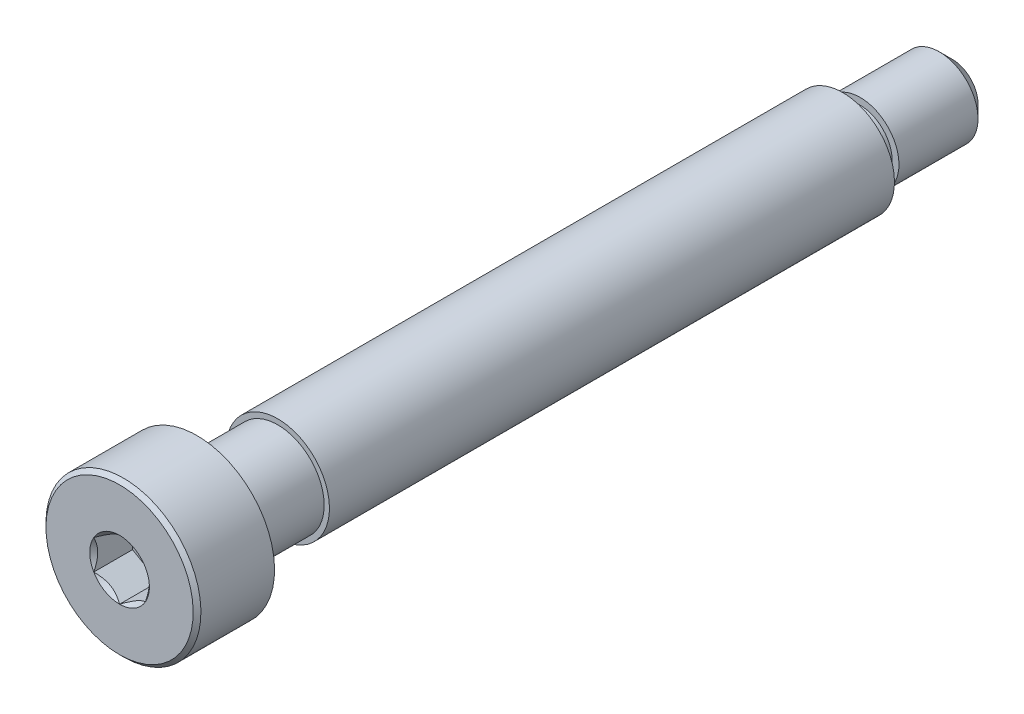
ISO-10303-21;
HEADER;
FILE_DESCRIPTION(('STEP AP214'),'2;1');
FILE_NAME('part.step','',(''),(''),'','','');
FILE_SCHEMA(('AUTOMOTIVE_DESIGN { 1 0 10303 214 1 1 1 1 }'));
ENDSEC;
DATA;
#1=APPLICATION_CONTEXT('core data for automotive mechanical design processes');
#2=APPLICATION_PROTOCOL_DEFINITION('international standard','automotive_design',2000,#1);
#3=PRODUCT_CONTEXT('',#1,'mechanical');
#4=PRODUCT('Part','Part','',(#3));
#5=PRODUCT_RELATED_PRODUCT_CATEGORY('part','',(#4));
#6=PRODUCT_DEFINITION_FORMATION('','',#4);
#7=PRODUCT_DEFINITION_CONTEXT('part definition',#1,'design');
#8=PRODUCT_DEFINITION('design','',#6,#7);
#9=PRODUCT_DEFINITION_SHAPE('','',#8);
#10=(LENGTH_UNIT() NAMED_UNIT(*) SI_UNIT(.MILLI.,.METRE.));
#11=(NAMED_UNIT(*) PLANE_ANGLE_UNIT() SI_UNIT($,.RADIAN.));
#12=(NAMED_UNIT(*) SI_UNIT($,.STERADIAN.) SOLID_ANGLE_UNIT());
#13=UNCERTAINTY_MEASURE_WITH_UNIT(LENGTH_MEASURE(1.E-05),#10,'distance_accuracy_value','');
#14=(GEOMETRIC_REPRESENTATION_CONTEXT(3) GLOBAL_UNCERTAINTY_ASSIGNED_CONTEXT((#13)) GLOBAL_UNIT_ASSIGNED_CONTEXT((#10,
#11,#12)) REPRESENTATION_CONTEXT('',''));
#15=CARTESIAN_POINT('',(0.,0.,0.));
#16=DIRECTION('',(0.,0.,1.));
#17=DIRECTION('',(1.,0.,0.));
#18=AXIS2_PLACEMENT_3D('',#15,#16,#17);
#19=CARTESIAN_POINT('',(0.,0.,16.121));
#20=DIRECTION('',(0.,0.,1.));
#21=DIRECTION('',(0.,-1.,0.));
#22=AXIS2_PLACEMENT_3D('',#19,#20,#21);
#23=CYLINDRICAL_SURFACE('',#22,3.);
#24=CARTESIAN_POINT('',(0.,0.,13.121));
#25=DIRECTION('',(0.,0.,1.));
#26=DIRECTION('',(0.,-1.,0.));
#27=AXIS2_PLACEMENT_3D('',#24,#25,#26);
#28=CIRCLE('',#27,3.);
#29=CARTESIAN_POINT('',(0.,-3.,13.121));
#30=VERTEX_POINT('',#29);
#31=EDGE_CURVE('E195',#30,#30,#28,.T.);
#32=ORIENTED_EDGE('',*,*,#31,.T.);
#33=EDGE_LOOP('',(#32));
#34=FACE_BOUND('',#33,.T.);
#35=CARTESIAN_POINT('',(0.,0.,15.971));
#36=DIRECTION('',(0.,0.,1.));
#37=DIRECTION('',(0.,-1.,0.));
#38=AXIS2_PLACEMENT_3D('',#35,#36,#37);
#39=CIRCLE('',#38,3.);
#40=CARTESIAN_POINT('',(0.,-3.,15.971));
#41=VERTEX_POINT('',#40);
#42=EDGE_CURVE('E455',#41,#41,#39,.T.);
#43=ORIENTED_EDGE('',*,*,#42,.F.);
#44=EDGE_LOOP('',(#43));
#45=FACE_BOUND('',#44,.T.);
#46=ADVANCED_FACE('F49',(#34,#45),#23,.T.);
#47=CARTESIAN_POINT('',(0.,2.,-11.879));
#48=DIRECTION('',(0.,0.,1.));
#49=DIRECTION('',(0.,-1.,0.));
#50=AXIS2_PLACEMENT_3D('',#47,#48,#49);
#51=PLANE('',#50);
#52=CARTESIAN_POINT('',(0.,0.,-11.879));
#53=DIRECTION('',(0.,0.,1.));
#54=DIRECTION('',(0.,-1.,0.));
#55=AXIS2_PLACEMENT_3D('',#52,#53,#54);
#56=CIRCLE('',#55,1.36904775);
#57=CARTESIAN_POINT('',(0.,-1.36904775,-11.879));
#58=VERTEX_POINT('',#57);
#59=EDGE_CURVE('E159',#58,#58,#56,.T.);
#60=ORIENTED_EDGE('',*,*,#59,.T.);
#61=EDGE_LOOP('',(#60));
#62=FACE_BOUND('',#61,.T.);
#63=CARTESIAN_POINT('',(0.,0.,-11.879));
#64=DIRECTION('',(0.,0.,1.));
#65=DIRECTION('',(0.,-1.,0.));
#66=AXIS2_PLACEMENT_3D('',#63,#64,#65);
#67=CIRCLE('',#66,1.5);
#68=CARTESIAN_POINT('',(0.,-1.5,-11.879));
#69=VERTEX_POINT('',#68);
#70=EDGE_CURVE('E186',#69,#69,#67,.T.);
#71=ORIENTED_EDGE('',*,*,#70,.F.);
#72=EDGE_LOOP('',(#71));
#73=FACE_BOUND('',#72,.T.);
#74=ADVANCED_FACE('F285',(#62,#73),#51,.F.);
#75=CARTESIAN_POINT('',(0.,1.5,-16.121));
#76=DIRECTION('',(0.,0.,1.));
#77=DIRECTION('',(0.,-1.,0.));
#78=AXIS2_PLACEMENT_3D('',#75,#76,#77);
#79=PLANE('',#78);
#80=CARTESIAN_POINT('',(0.,0.,-16.121));
#81=DIRECTION('',(0.,0.,1.));
#82=DIRECTION('',(0.,-1.,0.));
#83=AXIS2_PLACEMENT_3D('',#80,#81,#82);
#84=CIRCLE('',#83,0.99385198349999);
#85=CARTESIAN_POINT('',(0.,-0.99385198349999,-16.121));
#86=VERTEX_POINT('',#85);
#87=EDGE_CURVE('E12',#86,#86,#84,.F.);
#88=ORIENTED_EDGE('',*,*,#87,.T.);
#89=EDGE_LOOP('',(#88));
#90=FACE_BOUND('',#89,.T.);
#91=ADVANCED_FACE('F293',(#90),#79,.F.);
#92=CARTESIAN_POINT('',(0.,0.,16.121));
#93=DIRECTION('',(0.,0.,1.));
#94=DIRECTION('',(0.,-1.,0.));
#95=AXIS2_PLACEMENT_3D('',#92,#93,#94);
#96=CYLINDRICAL_SURFACE('',#95,1.5);
#97=CARTESIAN_POINT('',(0.,0.,-15.6148519835));
#98=DIRECTION('',(0.,0.,1.));
#99=DIRECTION('',(0.,-1.,0.));
#100=AXIS2_PLACEMENT_3D('',#97,#98,#99);
#101=CIRCLE('',#100,1.5);
#102=CARTESIAN_POINT('',(0.,-1.5,-15.6148519835));
#103=VERTEX_POINT('',#102);
#104=EDGE_CURVE('E58',#103,#103,#101,.T.);
#105=ORIENTED_EDGE('',*,*,#104,.T.);
#106=EDGE_LOOP('',(#105));
#107=FACE_BOUND('',#106,.T.);
#108=CARTESIAN_POINT('',(0.,0.,-12.553864022));
#109=DIRECTION('',(0.,0.,1.));
#110=DIRECTION('',(0.,-1.,0.));
#111=AXIS2_PLACEMENT_3D('',#108,#109,#110);
#112=CIRCLE('',#111,1.5);
#113=CARTESIAN_POINT('',(0.,-1.5,-12.553864022));
#114=VERTEX_POINT('',#113);
#115=EDGE_CURVE('E174',#114,#114,#112,.T.);
#116=ORIENTED_EDGE('',*,*,#115,.F.);
#117=EDGE_LOOP('',(#116));
#118=FACE_BOUND('',#117,.T.);
#119=ADVANCED_FACE('F489',(#107,#118),#96,.T.);
#120=CARTESIAN_POINT('',(0.,1.2380955,-12.553864022));
#121=DIRECTION('',(0.,0.,-1.));
#122=DIRECTION('',(0.,1.,0.));
#123=AXIS2_PLACEMENT_3D('',#120,#121,#122);
#124=PLANE('',#123);
#125=CARTESIAN_POINT('',(0.,0.,-12.553864022));
#126=DIRECTION('',(0.,0.,1.));
#127=DIRECTION('',(0.,-1.,0.));
#128=AXIS2_PLACEMENT_3D('',#125,#126,#127);
#129=CIRCLE('',#128,1.2380955);
#130=CARTESIAN_POINT('',(0.,-1.2380955,-12.553864022));
#131=VERTEX_POINT('',#130);
#132=EDGE_CURVE('E178',#131,#131,#129,.T.);
#133=ORIENTED_EDGE('',*,*,#132,.F.);
#134=EDGE_LOOP('',(#133));
#135=FACE_BOUND('',#134,.T.);
#136=ORIENTED_EDGE('',*,*,#115,.T.);
#137=EDGE_LOOP('',(#136));
#138=FACE_BOUND('',#137,.T.);
#139=ADVANCED_FACE('F332',(#135,#138),#124,.F.);
#140=CARTESIAN_POINT('',(0.,0.,16.121));
#141=DIRECTION('',(0.,0.,1.));
#142=DIRECTION('',(0.,-1.,0.));
#143=AXIS2_PLACEMENT_3D('',#140,#141,#142);
#144=CYLINDRICAL_SURFACE('',#143,1.2380955);
#145=CARTESIAN_POINT('',(0.,0.,-12.00995225));
#146=DIRECTION('',(0.,0.,1.));
#147=DIRECTION('',(0.,-1.,0.));
#148=AXIS2_PLACEMENT_3D('',#145,#146,#147);
#149=CIRCLE('',#148,1.2380955);
#150=CARTESIAN_POINT('',(0.,-1.2380955,-12.00995225));
#151=VERTEX_POINT('',#150);
#152=EDGE_CURVE('E182',#151,#151,#149,.T.);
#153=ORIENTED_EDGE('',*,*,#152,.F.);
#154=EDGE_LOOP('',(#153));
#155=FACE_BOUND('',#154,.T.);
#156=ORIENTED_EDGE('',*,*,#132,.T.);
#157=EDGE_LOOP('',(#156));
#158=FACE_BOUND('',#157,.T.);
#159=ADVANCED_FACE('F319',(#155,#158),#144,.T.);
#160=CARTESIAN_POINT('',(0.,0.,-12.00995225));
#161=DIRECTION('',(0.,0.,1.));
#162=DIRECTION('',(0.,-1.,0.));
#163=AXIS2_PLACEMENT_3D('',#160,#161,#162);
#164=TOROIDAL_SURFACE('',#163,1.36904775,0.13095225);
#165=ORIENTED_EDGE('',*,*,#59,.F.);
#166=EDGE_LOOP('',(#165));
#167=FACE_BOUND('',#166,.T.);
#168=ORIENTED_EDGE('',*,*,#152,.T.);
#169=EDGE_LOOP('',(#168));
#170=FACE_BOUND('',#169,.T.);
#171=ADVANCED_FACE('F314',(#167,#170),#164,.F.);
#172=CARTESIAN_POINT('',(0.,0.,-11.879));
#173=DIRECTION('',(0.,0.,-1.));
#174=DIRECTION('',(0.,1.,0.));
#175=AXIS2_PLACEMENT_3D('',#172,#173,#174);
#176=CONICAL_SURFACE('',#175,1.5,1.55722001811034);
#177=CARTESIAN_POINT('',(0.,0.,-11.8784827585288));
#178=DIRECTION('',(0.,0.,1.));
#179=DIRECTION('',(0.,-1.,0.));
#180=AXIS2_PLACEMENT_3D('',#177,#178,#179);
#181=CIRCLE('',#180,1.46190351116887);
#182=CARTESIAN_POINT('',(0.,-1.46190351116887,-11.8784827585288));
#183=VERTEX_POINT('',#182);
#184=EDGE_CURVE('E199',#183,#183,#181,.T.);
#185=ORIENTED_EDGE('',*,*,#184,.F.);
#186=EDGE_LOOP('',(#185));
#187=FACE_BOUND('',#186,.T.);
#188=ORIENTED_EDGE('',*,*,#70,.T.);
#189=EDGE_LOOP('',(#188));
#190=FACE_BOUND('',#189,.T.);
#191=ADVANCED_FACE('F311',(#187,#190),#176,.T.);
#192=CARTESIAN_POINT('',(0.,0.,9.99651724147122));
#193=DIRECTION('',(0.,0.,-1.));
#194=DIRECTION('',(0.,1.,0.));
#195=AXIS2_PLACEMENT_3D('',#192,#193,#194);
#196=CONICAL_SURFACE('',#195,1.75890351116887,1.55722001811025);
#197=CARTESIAN_POINT('',(0.,0.,9.996));
#198=DIRECTION('',(0.,0.,1.));
#199=DIRECTION('',(0.,-1.,0.));
#200=AXIS2_PLACEMENT_3D('',#197,#198,#199);
#201=CIRCLE('',#200,1.797);
#202=CARTESIAN_POINT('',(0.,-1.797,9.996));
#203=VERTEX_POINT('',#202);
#204=EDGE_CURVE('E194',#203,#203,#201,.T.);
#205=ORIENTED_EDGE('',*,*,#204,.F.);
#206=EDGE_LOOP('',(#205));
#207=FACE_BOUND('',#206,.T.);
#208=CARTESIAN_POINT('',(0.,0.,9.99651724147122));
#209=DIRECTION('',(0.,0.,1.));
#210=DIRECTION('',(0.,-1.,0.));
#211=AXIS2_PLACEMENT_3D('',#208,#209,#210);
#212=CIRCLE('',#211,1.75890351116887);
#213=CARTESIAN_POINT('',(0.,-1.75890351116887,9.99651724147122));
#214=VERTEX_POINT('',#213);
#215=EDGE_CURVE('E200',#214,#214,#212,.T.);
#216=ORIENTED_EDGE('',*,*,#215,.T.);
#217=EDGE_LOOP('',(#216));
#218=FACE_BOUND('',#217,.T.);
#219=ADVANCED_FACE('F307',(#207,#218),#196,.F.);
#220=CARTESIAN_POINT('',(0.,0.,9.99651724147122));
#221=DIRECTION('',(0.,0.,1.));
#222=DIRECTION('',(0.,-1.,0.));
#223=AXIS2_PLACEMENT_3D('',#220,#221,#222);
#224=CONICAL_SURFACE('',#223,1.75890351116887,0.0135763086846256);
#225=ORIENTED_EDGE('',*,*,#184,.T.);
#226=EDGE_LOOP('',(#225));
#227=FACE_BOUND('',#226,.T.);
#228=ORIENTED_EDGE('',*,*,#215,.F.);
#229=EDGE_LOOP('',(#228));
#230=FACE_BOUND('',#229,.T.);
#231=ADVANCED_FACE('F304',(#227,#230),#224,.T.);
#232=CARTESIAN_POINT('',(0.,3.,13.121));
#233=DIRECTION('',(0.,0.,1.));
#234=DIRECTION('',(0.,-1.,0.));
#235=AXIS2_PLACEMENT_3D('',#232,#233,#234);
#236=PLANE('',#235);
#237=ORIENTED_EDGE('',*,*,#31,.F.);
#238=EDGE_LOOP('',(#237));
#239=FACE_BOUND('',#238,.T.);
#240=CARTESIAN_POINT('',(0.,0.,13.121));
#241=DIRECTION('',(0.,0.,1.));
#242=DIRECTION('',(0.,-1.,0.));
#243=AXIS2_PLACEMENT_3D('',#240,#241,#242);
#244=CIRCLE('',#243,1.797);
#245=CARTESIAN_POINT('',(0.,-1.797,13.121));
#246=VERTEX_POINT('',#245);
#247=EDGE_CURVE('E190',#246,#246,#244,.T.);
#248=ORIENTED_EDGE('',*,*,#247,.T.);
#249=EDGE_LOOP('',(#248));
#250=FACE_BOUND('',#249,.T.);
#251=ADVANCED_FACE('F298',(#239,#250),#236,.F.);
#252=CARTESIAN_POINT('',(0.,0.,16.121));
#253=DIRECTION('',(0.,0.,1.));
#254=DIRECTION('',(0.,-1.,0.));
#255=AXIS2_PLACEMENT_3D('',#252,#253,#254);
#256=CYLINDRICAL_SURFACE('',#255,1.797);
#257=ORIENTED_EDGE('',*,*,#247,.F.);
#258=EDGE_LOOP('',(#257));
#259=FACE_BOUND('',#258,.T.);
#260=ORIENTED_EDGE('',*,*,#204,.T.);
#261=EDGE_LOOP('',(#260));
#262=FACE_BOUND('',#261,.T.);
#263=ADVANCED_FACE('F338',(#259,#262),#256,.T.);
#264=CARTESIAN_POINT('',(0.,0.,-15.6148519835));
#265=DIRECTION('',(0.,0.,1.));
#266=DIRECTION('',(0.,-1.,0.));
#267=AXIS2_PLACEMENT_3D('',#264,#265,#266);
#268=CONICAL_SURFACE('',#267,1.5,0.785398163397455);
#269=ORIENTED_EDGE('',*,*,#87,.F.);
#270=EDGE_LOOP('',(#269));
#271=FACE_BOUND('',#270,.T.);
#272=ORIENTED_EDGE('',*,*,#104,.F.);
#273=EDGE_LOOP('',(#272));
#274=FACE_BOUND('',#273,.T.);
#275=ADVANCED_FACE('F51',(#271,#274),#268,.T.);
#276=CARTESIAN_POINT('',(0.,0.,16.121));
#277=DIRECTION('',(0.,0.,-1.));
#278=DIRECTION('',(0.,1.,0.));
#279=AXIS2_PLACEMENT_3D('',#276,#277,#278);
#280=CONICAL_SURFACE('',#279,2.85,0.785398163397457);
#281=ORIENTED_EDGE('',*,*,#42,.T.);
#282=EDGE_LOOP('',(#281));
#283=FACE_BOUND('',#282,.T.);
#284=CARTESIAN_POINT('',(0.,0.,16.121));
#285=DIRECTION('',(0.,0.,1.));
#286=DIRECTION('',(0.,-1.,0.));
#287=AXIS2_PLACEMENT_3D('',#284,#285,#286);
#288=CIRCLE('',#287,2.85);
#289=CARTESIAN_POINT('',(0.,-2.85,16.121));
#290=VERTEX_POINT('',#289);
#291=EDGE_CURVE('E458',#290,#290,#288,.T.);
#292=ORIENTED_EDGE('',*,*,#291,.F.);
#293=EDGE_LOOP('',(#292));
#294=FACE_BOUND('',#293,.T.);
#295=ADVANCED_FACE('F230',(#283,#294),#280,.T.);
#296=CARTESIAN_POINT('',(0.,0.,14.621));
#297=DIRECTION('',(0.,0.,1.));
#298=DIRECTION('',(1.,0.,0.));
#299=AXIS2_PLACEMENT_3D('',#296,#297,#298);
#300=PLANE('',#299);
#301=DIRECTION('',(-0.866025403784439,0.499999999999999,0.));
#302=VECTOR('',#301,1.);
#303=CARTESIAN_POINT('',(1.,0.577350269189626,14.621));
#304=LINE('',#303,#302);
#305=CARTESIAN_POINT('',(1.,0.577350269189626,14.621));
#306=VERTEX_POINT('',#305);
#307=CARTESIAN_POINT('',(0.,1.15470053837925,14.621));
#308=VERTEX_POINT('',#307);
#309=EDGE_CURVE('E109',#306,#308,#304,.T.);
#310=ORIENTED_EDGE('',*,*,#309,.T.);
#311=DIRECTION('',(-0.866025403784438,-0.5,0.));
#312=VECTOR('',#311,1.);
#313=CARTESIAN_POINT('',(0.,1.15470053837925,14.621));
#314=LINE('',#313,#312);
#315=CARTESIAN_POINT('',(-1.,0.577350269189625,14.621));
#316=VERTEX_POINT('',#315);
#317=EDGE_CURVE('E120',#308,#316,#314,.T.);
#318=ORIENTED_EDGE('',*,*,#317,.T.);
#319=DIRECTION('',(0.,-1.,0.));
#320=VECTOR('',#319,1.);
#321=CARTESIAN_POINT('',(-1.,0.577350269189625,14.621));
#322=LINE('',#321,#320);
#323=CARTESIAN_POINT('',(-1.,-0.577350269189626,14.621));
#324=VERTEX_POINT('',#323);
#325=EDGE_CURVE('E127',#316,#324,#322,.T.);
#326=ORIENTED_EDGE('',*,*,#325,.T.);
#327=DIRECTION('',(0.866025403784439,-0.499999999999999,0.));
#328=VECTOR('',#327,1.);
#329=CARTESIAN_POINT('',(-1.,-0.577350269189626,14.621));
#330=LINE('',#329,#328);
#331=CARTESIAN_POINT('',(0.,-1.15470053837925,14.621));
#332=VERTEX_POINT('',#331);
#333=EDGE_CURVE('E147',#324,#332,#330,.T.);
#334=ORIENTED_EDGE('',*,*,#333,.T.);
#335=DIRECTION('',(0.866025403784438,0.5,0.));
#336=VECTOR('',#335,1.);
#337=CARTESIAN_POINT('',(0.,-1.15470053837925,14.621));
#338=LINE('',#337,#336);
#339=CARTESIAN_POINT('',(1.,-0.577350269189625,14.621));
#340=VERTEX_POINT('',#339);
#341=EDGE_CURVE('E151',#332,#340,#338,.T.);
#342=ORIENTED_EDGE('',*,*,#341,.T.);
#343=DIRECTION('',(0.,1.,0.));
#344=VECTOR('',#343,1.);
#345=CARTESIAN_POINT('',(1.,-0.577350269189625,14.621));
#346=LINE('',#345,#344);
#347=EDGE_CURVE('E117',#340,#306,#346,.T.);
#348=ORIENTED_EDGE('',*,*,#347,.T.);
#349=EDGE_LOOP('',(#310,#318,#326,#334,#342,#348));
#350=FACE_BOUND('',#349,.T.);
#351=ADVANCED_FACE('F129',(#350),#300,.T.);
#352=CARTESIAN_POINT('',(-1.,0.577350269189625,14.621));
#353=DIRECTION('',(-1.,0.,0.));
#354=DIRECTION('',(0.,-1.,0.));
#355=AXIS2_PLACEMENT_3D('',#352,#353,#354);
#356=PLANE('',#355);
#357=DIRECTION('',(0.,0.,1.));
#358=VECTOR('',#357,1.);
#359=CARTESIAN_POINT('',(-1.,0.577350269189625,14.621));
#360=LINE('',#359,#358);
#361=CARTESIAN_POINT('',(-0.999999999999999,0.577350269189626,16.121));
#362=VERTEX_POINT('',#361);
#363=EDGE_CURVE('E116',#316,#362,#360,.T.);
#364=ORIENTED_EDGE('',*,*,#363,.T.);
#365=CARTESIAN_POINT('',(-1.,-1.15147208646462,16.4913856775139));
#366=CARTESIAN_POINT('',(-1.,-1.12343447988552,16.4702199198737));
#367=CARTESIAN_POINT('',(-1.,-1.09524064850697,16.4492616921759));
#368=CARTESIAN_POINT('',(-1.,-1.03847715644376,16.4078460222356));
#369=CARTESIAN_POINT('',(-1.,-1.00990740382975,16.3873887061237));
#370=CARTESIAN_POINT('',(-1.,-0.923120894333478,16.3266047949545));
#371=CARTESIAN_POINT('',(-1.,-0.86425317375906,16.2871922289614));
#372=CARTESIAN_POINT('',(-1.,-0.740809858258045,16.2098206642002));
#373=CARTESIAN_POINT('',(-1.,-0.676100255137806,16.1720730391143));
#374=CARTESIAN_POINT('',(-1.,-0.543448939049123,16.1030245875513));
#375=CARTESIAN_POINT('',(-1.,-0.475519112027777,16.0717020278469));
#376=CARTESIAN_POINT('',(-1.,-0.373555850333527,16.0333817788838));
#377=CARTESIAN_POINT('',(-1.,-0.341031989670906,16.0223835916422));
#378=CARTESIAN_POINT('',(-1.,-0.275199079052292,16.0029983421474));
#379=CARTESIAN_POINT('',(-1.,-0.241889975173932,15.9946114597767));
#380=CARTESIAN_POINT('',(-1.,-0.175247517042992,15.981025220719));
#381=CARTESIAN_POINT('',(-1.,-0.141925568218174,15.975770790768));
#382=CARTESIAN_POINT('',(-1.,-0.0749144362322783,15.9685486865709));
#383=CARTESIAN_POINT('',(-1.,-0.0412251978501614,15.9665815136105));
#384=CARTESIAN_POINT('',(-1.,0.0249580992634208,15.9660831983932));
#385=CARTESIAN_POINT('',(-1.,0.0574512826460389,15.9674302678886));
#386=CARTESIAN_POINT('',(-1.,0.122148505701866,15.973216484499));
#387=CARTESIAN_POINT('',(-1.,0.154352610132926,15.9776549206615));
#388=CARTESIAN_POINT('',(-1.,0.218799898867639,15.9894568301452));
#389=CARTESIAN_POINT('',(-1.,0.251033743268953,15.9968705410385));
#390=CARTESIAN_POINT('',(-1.,0.314797132354918,16.0142289424987));
#391=CARTESIAN_POINT('',(-1.,0.346326735731004,16.0241734212888));
#392=CARTESIAN_POINT('',(-1.,0.445594187730204,16.0592234825543));
#393=CARTESIAN_POINT('',(-1.,0.511919139476035,16.0883208583567));
#394=CARTESIAN_POINT('',(-1.,0.641453244657531,16.1530153296865));
#395=CARTESIAN_POINT('',(-1.,0.704650133126343,16.1886357767152));
#396=CARTESIAN_POINT('',(-1.,0.825428490174986,16.2621239013469));
#397=CARTESIAN_POINT('',(-1.,0.883132947867685,16.2997919471355));
#398=CARTESIAN_POINT('',(-1.,0.968148853704567,16.3580228529432));
#399=CARTESIAN_POINT('',(-1.,0.996120570380287,16.3776384757629));
#400=CARTESIAN_POINT('',(-1.,1.05168177729902,16.4173885170613));
#401=CARTESIAN_POINT('',(-1.,1.079271369977,16.4375227921988));
#402=CARTESIAN_POINT('',(-1.,1.10670185346329,16.457872119073));
#403=B_SPLINE_CURVE_WITH_KNOTS('',3,(#365,#366,#367,#368,#369,#370,#371,#372,#373,#374,#375,
#376,#377,#378,#379,#380,#381,#382,#383,#384,#385,#386,#387,#388,#389,#390,#391,#392,#393,#394,
#395,#396,#397,#398,#399,#400,#401,#402),.UNSPECIFIED.,.F.,.F.,(4,2,2,2,2,2,2,2,2,2,2,2,2,2,2,2,
2,2,4),(0.,0.105386459083289,0.210799187330124,0.423233611565468,0.647793540908504,
0.871580877738611,0.97449307418142,1.07741235827201,1.17846428203205,1.27953161415762,
1.3769408673961,1.47432772585408,1.57343322804293,1.67253043972851,1.88917353996827,
2.10660791038813,2.31323734249843,2.41572589232045,2.51818641476503),.UNSPECIFIED.);
#404=CARTESIAN_POINT('',(-1.,-0.577350269189626,16.121));
#405=VERTEX_POINT('',#404);
#406=EDGE_CURVE('E237',#362,#405,#403,.F.);
#407=ORIENTED_EDGE('',*,*,#406,.T.);
#408=DIRECTION('',(0.,0.,1.));
#409=VECTOR('',#408,1.);
#410=CARTESIAN_POINT('',(-1.,-0.577350269189626,14.621));
#411=LINE('',#410,#409);
#412=EDGE_CURVE('E168',#324,#405,#411,.T.);
#413=ORIENTED_EDGE('',*,*,#412,.F.);
#414=ORIENTED_EDGE('',*,*,#325,.F.);
#415=EDGE_LOOP('',(#364,#407,#413,#414));
#416=FACE_BOUND('',#415,.T.);
#417=ADVANCED_FACE('F275',(#416),#356,.F.);
#418=CARTESIAN_POINT('',(-1.,-0.577350269189626,14.621));
#419=DIRECTION('',(-0.499999999999999,-0.866025403784439,0.));
#420=DIRECTION('',(0.866025403784439,-0.499999999999999,0.));
#421=AXIS2_PLACEMENT_3D('',#418,#419,#420);
#422=PLANE('',#421);
#423=ORIENTED_EDGE('',*,*,#412,.T.);
#424=CARTESIAN_POINT('',(-1.0002,-0.577234799135788,16.1211154873726));
#425=CARTESIAN_POINT('',(-0.965817404992819,-0.597085599618622,16.1012779308257));
#426=CARTESIAN_POINT('',(-0.930859881860175,-0.617268335009457,16.0826050206389));
#427=CARTESIAN_POINT('',(-0.859577197043909,-0.658423412276687,16.0484147427232));
#428=CARTESIAN_POINT('',(-0.823245249471015,-0.679399671988081,16.0329164090235));
#429=CARTESIAN_POINT('',(-0.749983386196688,-0.721697428470847,16.0063673071423));
#430=CARTESIAN_POINT('',(-0.713072148554585,-0.743008141459637,15.9952497739969));
#431=CARTESIAN_POINT('',(-0.63843727068914,-0.786098608286186,15.9781198657762));
#432=CARTESIAN_POINT('',(-0.600715911891363,-0.807877044942281,15.9720946974667));
#433=CARTESIAN_POINT('',(-0.535707801582066,-0.845409494928863,15.9666605549675));
#434=CARTESIAN_POINT('',(-0.508505628471827,-0.861114676896602,15.9658569383167));
#435=CARTESIAN_POINT('',(-0.454153959330887,-0.892494627706029,15.9672066994169));
#436=CARTESIAN_POINT('',(-0.427004476245124,-0.908169389073954,15.9693607295472));
#437=CARTESIAN_POINT('',(-0.345943722673039,-0.954969836969511,15.9801169721285));
#438=CARTESIAN_POINT('',(-0.292435859021572,-0.985862616452447,15.9930145564154));
#439=CARTESIAN_POINT('',(-0.198523934856568,-1.04008269114923,16.0241407306022));
#440=CARTESIAN_POINT('',(-0.157679476328165,-1.06366425027551,16.0407377977018));
#441=CARTESIAN_POINT('',(-0.0775903626180559,-1.1099037216352,16.0781249246853));
#442=CARTESIAN_POINT('',(-0.0383409891295615,-1.1325643579843,16.0989013418174));
#443=CARTESIAN_POINT('',(0.000200000000000454,-1.15481600843309,16.1211154873726));
#444=B_SPLINE_CURVE_WITH_KNOTS('',3,(#424,#425,#426,#427,#428,#429,#430,#431,#432,#433,#434,
#435,#436,#437,#438,#439,#440,#441,#442,#443),.UNSPECIFIED.,.F.,.F.,(4,2,2,2,2,2,2,2,2,4),(0.,
0.13323767682856,0.267252229834491,0.3991370762693,0.530689603280768,0.624814864263846,
0.718960890149133,0.907306626112097,1.05710100361789,1.20641411519286),.UNSPECIFIED.);
#445=CARTESIAN_POINT('',(0.,-1.15470053837925,16.121));
#446=VERTEX_POINT('',#445);
#447=EDGE_CURVE('E245',#405,#446,#444,.T.);
#448=ORIENTED_EDGE('',*,*,#447,.T.);
#449=DIRECTION('',(0.,0.,1.));
#450=VECTOR('',#449,1.);
#451=CARTESIAN_POINT('',(0.,-1.15470053837925,14.621));
#452=LINE('',#451,#450);
#453=EDGE_CURVE('E164',#332,#446,#452,.T.);
#454=ORIENTED_EDGE('',*,*,#453,.F.);
#455=ORIENTED_EDGE('',*,*,#333,.F.);
#456=EDGE_LOOP('',(#423,#448,#454,#455));
#457=FACE_BOUND('',#456,.T.);
#458=ADVANCED_FACE('F271',(#457),#422,.F.);
#459=CARTESIAN_POINT('',(0.,-1.15470053837925,14.621));
#460=DIRECTION('',(0.5,-0.866025403784439,0.));
#461=DIRECTION('',(0.866025403784439,0.5,0.));
#462=AXIS2_PLACEMENT_3D('',#459,#460,#461);
#463=PLANE('',#462);
#464=ORIENTED_EDGE('',*,*,#453,.T.);
#465=CARTESIAN_POINT('',(-0.000199999999999206,-1.15481600843309,16.1211154873726));
#466=CARTESIAN_POINT('',(0.0341825950071813,-1.13496520795026,16.1012779308257));
#467=CARTESIAN_POINT('',(0.0691401181398254,-1.11478247255942,16.0826050206389));
#468=CARTESIAN_POINT('',(0.14042280295609,-1.07362739529219,16.0484147427232));
#469=CARTESIAN_POINT('',(0.176754750528985,-1.0526511355808,16.0329164090235));
#470=CARTESIAN_POINT('',(0.250016613803312,-1.01035337909803,16.0063673071423));
#471=CARTESIAN_POINT('',(0.286927851445415,-0.98904266610924,15.9952497739969));
#472=CARTESIAN_POINT('',(0.36156272931086,-0.94595219928269,15.9781198657762));
#473=CARTESIAN_POINT('',(0.399284088108637,-0.924173762626596,15.9720946974667));
#474=CARTESIAN_POINT('',(0.464292198417934,-0.886641312640014,15.9666605549675));
#475=CARTESIAN_POINT('',(0.491494371528173,-0.870936130672275,15.9658569383167));
#476=CARTESIAN_POINT('',(0.545846040669112,-0.839556179862848,15.9672066994169));
#477=CARTESIAN_POINT('',(0.572995523754876,-0.823881418494923,15.9693607295472));
#478=CARTESIAN_POINT('',(0.65405627732696,-0.777080970599366,15.9801169721285));
#479=CARTESIAN_POINT('',(0.707564140978428,-0.74618819111643,15.9930145564154));
#480=CARTESIAN_POINT('',(0.801476065143431,-0.691968116419649,16.0241407306022));
#481=CARTESIAN_POINT('',(0.842320523671834,-0.668386557293372,16.0407377977018));
#482=CARTESIAN_POINT('',(0.922409637381943,-0.622147085933681,16.0781249246853));
#483=CARTESIAN_POINT('',(0.961659010870437,-0.599486449584575,16.0989013418174));
#484=CARTESIAN_POINT('',(1.0002,-0.577234799135788,16.1211154873726));
#485=B_SPLINE_CURVE_WITH_KNOTS('',3,(#465,#466,#467,#468,#469,#470,#471,#472,#473,#474,#475,
#476,#477,#478,#479,#480,#481,#482,#483,#484),.UNSPECIFIED.,.F.,.F.,(4,2,2,2,2,2,2,2,2,4),(0.,
0.133237676828559,0.267252229834491,0.3991370762693,0.530689603280768,0.624814864263846,
0.718960890149133,0.907306626112097,1.05710100361789,1.20641411519286),.UNSPECIFIED.);
#486=CARTESIAN_POINT('',(1.,-0.577350269189626,16.121));
#487=VERTEX_POINT('',#486);
#488=EDGE_CURVE('E252',#446,#487,#485,.T.);
#489=ORIENTED_EDGE('',*,*,#488,.T.);
#490=DIRECTION('',(0.,0.,1.));
#491=VECTOR('',#490,1.);
#492=CARTESIAN_POINT('',(1.,-0.577350269189625,14.621));
#493=LINE('',#492,#491);
#494=EDGE_CURVE('E160',#340,#487,#493,.T.);
#495=ORIENTED_EDGE('',*,*,#494,.F.);
#496=ORIENTED_EDGE('',*,*,#341,.F.);
#497=EDGE_LOOP('',(#464,#489,#495,#496));
#498=FACE_BOUND('',#497,.T.);
#499=ADVANCED_FACE('F267',(#498),#463,.F.);
#500=CARTESIAN_POINT('',(1.,-0.577350269189625,14.621));
#501=DIRECTION('',(1.,0.,0.));
#502=DIRECTION('',(0.,1.,0.));
#503=AXIS2_PLACEMENT_3D('',#500,#501,#502);
#504=PLANE('',#503);
#505=ORIENTED_EDGE('',*,*,#494,.T.);
#506=CARTESIAN_POINT('',(1.,-1.15147208663215,16.4913856776404));
#507=CARTESIAN_POINT('',(1.,-1.12343448004835,16.4702199199953));
#508=CARTESIAN_POINT('',(1.,-1.09524064866508,16.4492616922927));
#509=CARTESIAN_POINT('',(1.,-1.0384771565924,16.4078460223427));
#510=CARTESIAN_POINT('',(1.,-1.00990740397362,16.3873887062259));
#511=CARTESIAN_POINT('',(1.,-0.923120894462773,16.3266047950421));
#512=CARTESIAN_POINT('',(1.,-0.864253173878442,16.2871922290393));
#513=CARTESIAN_POINT('',(1.,-0.740809858355808,16.2098206642582));
#514=CARTESIAN_POINT('',(1.,-0.676100255223805,16.1720730391622));
#515=CARTESIAN_POINT('',(1.,-0.543448939110595,16.1030245875803));
#516=CARTESIAN_POINT('',(1.,-0.475519112076494,16.0717020278671));
#517=CARTESIAN_POINT('',(1.,-0.373555850372647,16.0333817788976));
#518=CARTESIAN_POINT('',(1.,-0.341031989714045,16.0223835916562));
#519=CARTESIAN_POINT('',(1.,-0.275199079103601,16.0029983421611));
#520=CARTESIAN_POINT('',(1.,-0.241889975229392,15.9946114597899));
#521=CARTESIAN_POINT('',(1.,-0.175247517106615,15.9810252207301));
#522=CARTESIAN_POINT('',(1.,-0.141925568285808,15.9757707907776));
#523=CARTESIAN_POINT('',(1.,-0.074914436307802,15.9685486865767));
#524=CARTESIAN_POINT('',(1.,-0.0412251979295638,15.9665815136139));
#525=CARTESIAN_POINT('',(1.,0.0249580991768634,15.9660831983911));
#526=CARTESIAN_POINT('',(1.,0.0574512825561951,15.9674302678836));
#527=CARTESIAN_POINT('',(1.,0.122148505605778,15.9732164844874));
#528=CARTESIAN_POINT('',(1.,0.15435261003388,15.9776549206465));
#529=CARTESIAN_POINT('',(1.,0.218799898762754,15.9894568301229));
#530=CARTESIAN_POINT('',(1.,0.251033743161195,15.9968705410123));
#531=CARTESIAN_POINT('',(1.,0.314797132241693,16.0142289424647));
#532=CARTESIAN_POINT('',(1.,0.346326735615182,16.0241734212509));
#533=CARTESIAN_POINT('',(1.,0.445594187589162,16.0592234824979));
#534=CARTESIAN_POINT('',(1.,0.511919139313633,16.0883208582833));
#535=CARTESIAN_POINT('',(1.,0.641453244454046,16.1530153295771));
#536=CARTESIAN_POINT('',(1.,0.704650132903147,16.188635776587));
#537=CARTESIAN_POINT('',(1.,0.825428489916351,16.2621239011824));
#538=CARTESIAN_POINT('',(1.,0.883132947593196,16.2997919469538));
#539=CARTESIAN_POINT('',(1.,0.968148853406636,16.3580228527359));
#540=CARTESIAN_POINT('',(1.,0.996120570074655,16.3776384755472));
#541=CARTESIAN_POINT('',(1.,1.05168177697803,16.4173885168287));
#542=CARTESIAN_POINT('',(1.,1.07927136964837,16.4375227919578));
#543=CARTESIAN_POINT('',(1.,1.10670185312702,16.4578721188235));
#544=B_SPLINE_CURVE_WITH_KNOTS('',3,(#506,#507,#508,#509,#510,#511,#512,#513,#514,#515,#516,
#517,#518,#519,#520,#521,#522,#523,#524,#525,#526,#527,#528,#529,#530,#531,#532,#533,#534,#535,
#536,#537,#538,#539,#540,#541,#542,#543),.UNSPECIFIED.,.F.,.F.,(4,2,2,2,2,2,2,2,2,2,2,2,2,2,2,2,
2,2,4),(0.,0.105386459103352,0.210799187370249,0.423233611646474,0.64779354103535,
0.871580877910863,0.974493074342051,1.07741235842104,1.17846428216995,1.27953161428439,
1.37694086751269,1.47432772596047,1.57343322813834,1.67253043981295,1.88917353997385,
2.10660791031433,2.31323734235671,2.41572589214522,2.51818641455631),.UNSPECIFIED.);
#545=CARTESIAN_POINT('',(1.,0.577350269189624,16.121));
#546=VERTEX_POINT('',#545);
#547=EDGE_CURVE('E135',#487,#546,#544,.T.);
#548=ORIENTED_EDGE('',*,*,#547,.T.);
#549=DIRECTION('',(0.,0.,1.));
#550=VECTOR('',#549,1.);
#551=CARTESIAN_POINT('',(1.,0.577350269189626,14.621));
#552=LINE('',#551,#550);
#553=EDGE_CURVE('E156',#306,#546,#552,.T.);
#554=ORIENTED_EDGE('',*,*,#553,.F.);
#555=ORIENTED_EDGE('',*,*,#347,.F.);
#556=EDGE_LOOP('',(#505,#548,#554,#555));
#557=FACE_BOUND('',#556,.T.);
#558=ADVANCED_FACE('F264',(#557),#504,.F.);
#559=CARTESIAN_POINT('',(1.,0.577350269189626,14.621));
#560=DIRECTION('',(0.499999999999999,0.866025403784439,0.));
#561=DIRECTION('',(-0.866025403784439,0.499999999999999,0.));
#562=AXIS2_PLACEMENT_3D('',#559,#560,#561);
#563=PLANE('',#562);
#564=ORIENTED_EDGE('',*,*,#553,.T.);
#565=CARTESIAN_POINT('',(1.0002,0.577234799135788,16.1211154873726));
#566=CARTESIAN_POINT('',(0.96581740499282,0.597085599618621,16.1012779308257));
#567=CARTESIAN_POINT('',(0.930859881860176,0.617268335009456,16.0826050206389));
#568=CARTESIAN_POINT('',(0.859577197043911,0.658423412276686,16.0484147427232));
#569=CARTESIAN_POINT('',(0.823245249471016,0.67939967198808,16.0329164090235));
#570=CARTESIAN_POINT('',(0.749983386196689,0.721697428470846,16.0063673071423));
#571=CARTESIAN_POINT('',(0.713072148554586,0.743008141459637,15.9952497739969));
#572=CARTESIAN_POINT('',(0.638437270689142,0.786098608286186,15.9781198657762));
#573=CARTESIAN_POINT('',(0.600715911891365,0.80787704494228,15.9720946974667));
#574=CARTESIAN_POINT('',(0.535707801582068,0.845409494928862,15.9666605549675));
#575=CARTESIAN_POINT('',(0.508505628471829,0.861114676896601,15.9658569383167));
#576=CARTESIAN_POINT('',(0.454153959330889,0.892494627706028,15.9672066994169));
#577=CARTESIAN_POINT('',(0.427004476245126,0.908169389073953,15.9693607295472));
#578=CARTESIAN_POINT('',(0.345943722673041,0.95496983696951,15.9801169721285));
#579=CARTESIAN_POINT('',(0.292435859021574,0.985862616452446,15.9930145564154));
#580=CARTESIAN_POINT('',(0.19852393485657,1.04008269114923,16.0241407306022));
#581=CARTESIAN_POINT('',(0.157679476328167,1.0636642502755,16.0407377977018));
#582=CARTESIAN_POINT('',(0.0775903626180574,1.1099037216352,16.0781249246853));
#583=CARTESIAN_POINT('',(0.0383409891295628,1.1325643579843,16.0989013418174));
#584=CARTESIAN_POINT('',(-0.000199999999999836,1.15481600843309,16.1211154873726));
#585=B_SPLINE_CURVE_WITH_KNOTS('',3,(#565,#566,#567,#568,#569,#570,#571,#572,#573,#574,#575,
#576,#577,#578,#579,#580,#581,#582,#583,#584),.UNSPECIFIED.,.F.,.F.,(4,2,2,2,2,2,2,2,2,4),(0.,
0.133237676828559,0.267252229834492,0.399137076269301,0.530689603280768,0.624814864263846,
0.718960890149133,0.907306626112097,1.05710100361789,1.20641411519286),.UNSPECIFIED.);
#586=CARTESIAN_POINT('',(0.,1.15470053837925,16.121));
#587=VERTEX_POINT('',#586);
#588=EDGE_CURVE('E111',#546,#587,#585,.T.);
#589=ORIENTED_EDGE('',*,*,#588,.T.);
#590=DIRECTION('',(0.,0.,1.));
#591=VECTOR('',#590,1.);
#592=CARTESIAN_POINT('',(0.,1.15470053837925,14.621));
#593=LINE('',#592,#591);
#594=EDGE_CURVE('E104',#308,#587,#593,.T.);
#595=ORIENTED_EDGE('',*,*,#594,.F.);
#596=ORIENTED_EDGE('',*,*,#309,.F.);
#597=EDGE_LOOP('',(#564,#589,#595,#596));
#598=FACE_BOUND('',#597,.T.);
#599=ADVANCED_FACE('F107',(#598),#563,.F.);
#600=CARTESIAN_POINT('',(0.,1.15470053837925,14.621));
#601=DIRECTION('',(-0.5,0.866025403784439,0.));
#602=DIRECTION('',(-0.866025403784439,-0.5,0.));
#603=AXIS2_PLACEMENT_3D('',#600,#601,#602);
#604=PLANE('',#603);
#605=ORIENTED_EDGE('',*,*,#594,.T.);
#606=CARTESIAN_POINT('',(0.000199999999999905,1.15481600843309,16.1211154873726));
#607=CARTESIAN_POINT('',(-0.0341825950071801,1.13496520795026,16.1012779308257));
#608=CARTESIAN_POINT('',(-0.0691401181398239,1.11478247255942,16.0826050206389));
#609=CARTESIAN_POINT('',(-0.140422802956088,1.07362739529219,16.0484147427232));
#610=CARTESIAN_POINT('',(-0.176754750528983,1.0526511355808,16.0329164090235));
#611=CARTESIAN_POINT('',(-0.25001661380331,1.01035337909803,16.0063673071423));
#612=CARTESIAN_POINT('',(-0.286927851445413,0.989042666109241,15.9952497739969));
#613=CARTESIAN_POINT('',(-0.361562729310858,0.945952199282692,15.9781198657762));
#614=CARTESIAN_POINT('',(-0.399284088108635,0.924173762626597,15.9720946974667));
#615=CARTESIAN_POINT('',(-0.464292198417932,0.886641312640015,15.9666605549675));
#616=CARTESIAN_POINT('',(-0.491494371528171,0.870936130672276,15.9658569383167));
#617=CARTESIAN_POINT('',(-0.545846040669111,0.839556179862849,15.9672066994169));
#618=CARTESIAN_POINT('',(-0.572995523754874,0.823881418494924,15.9693607295472));
#619=CARTESIAN_POINT('',(-0.654056277326959,0.777080970599367,15.9801169721285));
#620=CARTESIAN_POINT('',(-0.707564140978426,0.74618819111643,15.9930145564154));
#621=CARTESIAN_POINT('',(-0.801476065143431,0.691968116419649,16.0241407306022));
#622=CARTESIAN_POINT('',(-0.842320523671834,0.668386557293371,16.0407377977018));
#623=CARTESIAN_POINT('',(-0.922409637381944,0.62214708593368,16.0781249246853));
#624=CARTESIAN_POINT('',(-0.961659010870439,0.599486449584574,16.0989013418174));
#625=CARTESIAN_POINT('',(-1.0002,0.577234799135787,16.1211154873726));
#626=B_SPLINE_CURVE_WITH_KNOTS('',3,(#606,#607,#608,#609,#610,#611,#612,#613,#614,#615,#616,
#617,#618,#619,#620,#621,#622,#623,#624,#625),.UNSPECIFIED.,.F.,.F.,(4,2,2,2,2,2,2,2,2,4),(0.,
0.133237676828558,0.26725222983449,0.3991370762693,0.530689603280768,0.624814864263846,
0.718960890149133,0.907306626112097,1.0571010036179,1.20641411519286),.UNSPECIFIED.);
#627=EDGE_CURVE('E213',#587,#362,#626,.T.);
#628=ORIENTED_EDGE('',*,*,#627,.T.);
#629=ORIENTED_EDGE('',*,*,#363,.F.);
#630=ORIENTED_EDGE('',*,*,#317,.F.);
#631=EDGE_LOOP('',(#605,#628,#629,#630));
#632=FACE_BOUND('',#631,.T.);
#633=ADVANCED_FACE('F121',(#632),#604,.F.);
#634=CARTESIAN_POINT('',(0.,0.,16.121));
#635=DIRECTION('',(0.,0.,1.));
#636=DIRECTION('',(1.,0.,0.));
#637=AXIS2_PLACEMENT_3D('',#634,#635,#636);
#638=CONICAL_SURFACE('',#637,1.15470053837925,0.78539816339745);
#639=CARTESIAN_POINT('',(0.,0.,16.121));
#640=DIRECTION('',(0.,0.,1.));
#641=DIRECTION('',(1.,0.,0.));
#642=AXIS2_PLACEMENT_3D('',#639,#640,#641);
#643=CIRCLE('',#642,1.15470053837925);
#644=EDGE_CURVE('E474',#362,#405,#643,.T.);
#645=ORIENTED_EDGE('',*,*,#644,.T.);
#646=ORIENTED_EDGE('',*,*,#406,.F.);
#647=EDGE_LOOP('',(#645,#646));
#648=FACE_BOUND('',#647,.T.);
#649=ADVANCED_FACE('F391',(#648),#638,.F.);
#650=EDGE_CURVE('E477',#405,#446,#643,.T.);
#651=ORIENTED_EDGE('',*,*,#650,.T.);
#652=ORIENTED_EDGE('',*,*,#447,.F.);
#653=EDGE_LOOP('',(#651,#652));
#654=FACE_BOUND('',#653,.T.);
#655=ADVANCED_FACE('F407',(#654),#638,.F.);
#656=EDGE_CURVE('E71',#446,#487,#643,.T.);
#657=ORIENTED_EDGE('',*,*,#656,.T.);
#658=ORIENTED_EDGE('',*,*,#488,.F.);
#659=EDGE_LOOP('',(#657,#658));
#660=FACE_BOUND('',#659,.T.);
#661=ADVANCED_FACE('F414',(#660),#638,.F.);
#662=EDGE_CURVE('E64',#487,#546,#643,.T.);
#663=ORIENTED_EDGE('',*,*,#662,.T.);
#664=ORIENTED_EDGE('',*,*,#547,.F.);
#665=EDGE_LOOP('',(#663,#664));
#666=FACE_BOUND('',#665,.T.);
#667=ADVANCED_FACE('F228',(#666),#638,.F.);
#668=EDGE_CURVE('E464',#546,#587,#643,.T.);
#669=ORIENTED_EDGE('',*,*,#668,.T.);
#670=ORIENTED_EDGE('',*,*,#588,.F.);
#671=EDGE_LOOP('',(#669,#670));
#672=FACE_BOUND('',#671,.T.);
#673=ADVANCED_FACE('F222',(#672),#638,.F.);
#674=EDGE_CURVE('E467',#587,#362,#643,.T.);
#675=ORIENTED_EDGE('',*,*,#674,.T.);
#676=ORIENTED_EDGE('',*,*,#627,.F.);
#677=EDGE_LOOP('',(#675,#676));
#678=FACE_BOUND('',#677,.T.);
#679=ADVANCED_FACE('F227',(#678),#638,.F.);
#680=CARTESIAN_POINT('',(0.,0.,16.121));
#681=DIRECTION('',(0.,0.,-1.));
#682=DIRECTION('',(0.,1.,0.));
#683=AXIS2_PLACEMENT_3D('',#680,#681,#682);
#684=PLANE('',#683);
#685=ORIENTED_EDGE('',*,*,#674,.F.);
#686=ORIENTED_EDGE('',*,*,#668,.F.);
#687=ORIENTED_EDGE('',*,*,#662,.F.);
#688=ORIENTED_EDGE('',*,*,#656,.F.);
#689=ORIENTED_EDGE('',*,*,#650,.F.);
#690=ORIENTED_EDGE('',*,*,#644,.F.);
#691=EDGE_LOOP('',(#685,#686,#687,#688,#689,#690));
#692=FACE_BOUND('',#691,.T.);
#693=ORIENTED_EDGE('',*,*,#291,.T.);
#694=EDGE_LOOP('',(#693));
#695=FACE_BOUND('',#694,.T.);
#696=ADVANCED_FACE('F300',(#692,#695),#684,.F.);
#697=CLOSED_SHELL('',(#46,#74,#91,#119,#139,#159,#171,#191,#219,#231,#251,#263,#275,#295,#351,
#417,#458,#499,#558,#599,#633,#649,#655,#661,#667,#673,#679,#696));
#698=MANIFOLD_SOLID_BREP('B2',#697);
#699=CARTESIAN_POINT('',(0.,2.,-11.879));
#700=DIRECTION('',(0.,0.,1.));
#701=DIRECTION('',(0.,-1.,0.));
#702=AXIS2_PLACEMENT_3D('',#699,#700,#701);
#703=PLANE('',#702);
#704=CARTESIAN_POINT('',(0.,0.,-11.879));
#705=DIRECTION('',(0.,0.,1.));
#706=DIRECTION('',(0.,-1.,0.));
#707=AXIS2_PLACEMENT_3D('',#704,#705,#706);
#708=CIRCLE('',#707,1.5);
#709=CARTESIAN_POINT('',(0.,-1.5,-11.879));
#710=VERTEX_POINT('',#709);
#711=EDGE_CURVE('E48',#710,#710,#708,.T.);
#712=ORIENTED_EDGE('',*,*,#711,.T.);
#713=EDGE_LOOP('',(#712));
#714=FACE_BOUND('',#713,.T.);
#715=CARTESIAN_POINT('',(0.,0.,-11.879));
#716=DIRECTION('',(0.,0.,1.));
#717=DIRECTION('',(0.,-1.,0.));
#718=AXIS2_PLACEMENT_3D('',#715,#716,#717);
#719=CIRCLE('',#718,2.);
#720=CARTESIAN_POINT('',(0.,-2.,-11.879));
#721=VERTEX_POINT('',#720);
#722=EDGE_CURVE('E539',#721,#721,#719,.T.);
#723=ORIENTED_EDGE('',*,*,#722,.F.);
#724=EDGE_LOOP('',(#723));
#725=FACE_BOUND('',#724,.T.);
#726=ADVANCED_FACE('F536',(#714,#725),#703,.F.);
#727=CARTESIAN_POINT('',(0.,0.,16.121));
#728=DIRECTION('',(0.,0.,1.));
#729=DIRECTION('',(0.,-1.,0.));
#730=AXIS2_PLACEMENT_3D('',#727,#728,#729);
#731=CYLINDRICAL_SURFACE('',#730,2.);
#732=CARTESIAN_POINT('',(0.,0.,9.996));
#733=DIRECTION('',(0.,0.,1.));
#734=DIRECTION('',(0.,-1.,0.));
#735=AXIS2_PLACEMENT_3D('',#732,#733,#734);
#736=CIRCLE('',#735,2.);
#737=CARTESIAN_POINT('',(0.,-2.,9.996));
#738=VERTEX_POINT('',#737);
#739=EDGE_CURVE('E549',#738,#738,#736,.T.);
#740=ORIENTED_EDGE('',*,*,#739,.F.);
#741=EDGE_LOOP('',(#740));
#742=FACE_BOUND('',#741,.T.);
#743=ORIENTED_EDGE('',*,*,#722,.T.);
#744=EDGE_LOOP('',(#743));
#745=FACE_BOUND('',#744,.T.);
#746=ADVANCED_FACE('F556',(#742,#745),#731,.T.);
#747=CARTESIAN_POINT('',(0.,1.797,9.996));
#748=DIRECTION('',(0.,0.,-1.));
#749=DIRECTION('',(0.,1.,0.));
#750=AXIS2_PLACEMENT_3D('',#747,#748,#749);
#751=PLANE('',#750);
#752=CARTESIAN_POINT('',(0.,0.,9.996));
#753=DIRECTION('',(0.,0.,1.));
#754=DIRECTION('',(0.,-1.,0.));
#755=AXIS2_PLACEMENT_3D('',#752,#753,#754);
#756=CIRCLE('',#755,1.797);
#757=CARTESIAN_POINT('',(0.,-1.797,9.996));
#758=VERTEX_POINT('',#757);
#759=EDGE_CURVE('E543',#758,#758,#756,.T.);
#760=ORIENTED_EDGE('',*,*,#759,.F.);
#761=EDGE_LOOP('',(#760));
#762=FACE_BOUND('',#761,.T.);
#763=ORIENTED_EDGE('',*,*,#739,.T.);
#764=EDGE_LOOP('',(#763));
#765=FACE_BOUND('',#764,.T.);
#766=ADVANCED_FACE('F564',(#762,#765),#751,.F.);
#767=CARTESIAN_POINT('',(0.,0.,9.996));
#768=DIRECTION('',(0.,0.,1.));
#769=DIRECTION('',(0.,-1.,0.));
#770=AXIS2_PLACEMENT_3D('',#767,#768,#769);
#771=CONICAL_SURFACE('',#770,1.797,0.0135763086846256);
#772=ORIENTED_EDGE('',*,*,#711,.F.);
#773=EDGE_LOOP('',(#772));
#774=FACE_BOUND('',#773,.T.);
#775=ORIENTED_EDGE('',*,*,#759,.T.);
#776=EDGE_LOOP('',(#775));
#777=FACE_BOUND('',#776,.T.);
#778=ADVANCED_FACE('F568',(#774,#777),#771,.F.);
#779=CLOSED_SHELL('',(#726,#746,#766,#778));
#780=MANIFOLD_SOLID_BREP('B6',#779);
#781=ADVANCED_BREP_SHAPE_REPRESENTATION('',(#18,#698,#780),#14);
#782=SHAPE_DEFINITION_REPRESENTATION(#9,#781);
ENDSEC;
END-ISO-10303-21;
